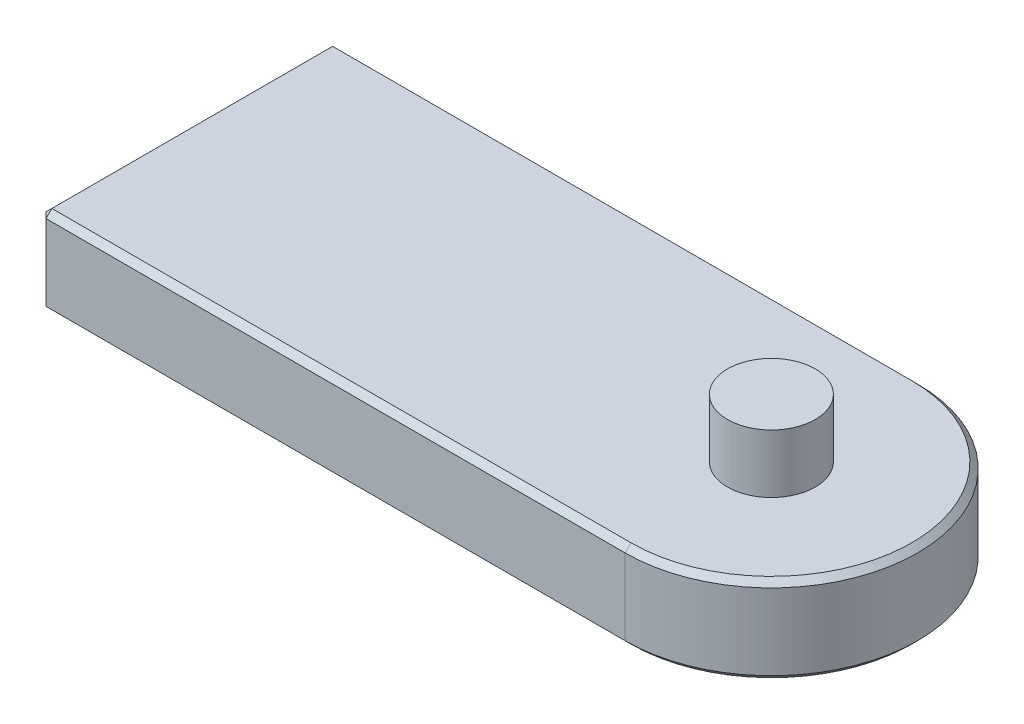
ISO-10303-21;
HEADER;
FILE_DESCRIPTION(('STEP AP214'),'2;1');
FILE_NAME('part.step','',(''),(''),'','','');
FILE_SCHEMA(('AUTOMOTIVE_DESIGN { 1 0 10303 214 1 1 1 1 }'));
ENDSEC;
DATA;
#1=APPLICATION_CONTEXT('core data for automotive mechanical design processes');
#2=APPLICATION_PROTOCOL_DEFINITION('international standard','automotive_design',2000,#1);
#3=PRODUCT_CONTEXT('',#1,'mechanical');
#4=PRODUCT('Part','Part','',(#3));
#5=PRODUCT_RELATED_PRODUCT_CATEGORY('part','',(#4));
#6=PRODUCT_DEFINITION_FORMATION('','',#4);
#7=PRODUCT_DEFINITION_CONTEXT('part definition',#1,'design');
#8=PRODUCT_DEFINITION('design','',#6,#7);
#9=PRODUCT_DEFINITION_SHAPE('','',#8);
#10=(LENGTH_UNIT() NAMED_UNIT(*) SI_UNIT(.MILLI.,.METRE.));
#11=(NAMED_UNIT(*) PLANE_ANGLE_UNIT() SI_UNIT($,.RADIAN.));
#12=(NAMED_UNIT(*) SI_UNIT($,.STERADIAN.) SOLID_ANGLE_UNIT());
#13=UNCERTAINTY_MEASURE_WITH_UNIT(LENGTH_MEASURE(1.E-05),#10,'distance_accuracy_value','');
#14=(GEOMETRIC_REPRESENTATION_CONTEXT(3) GLOBAL_UNCERTAINTY_ASSIGNED_CONTEXT((#13)) GLOBAL_UNIT_ASSIGNED_CONTEXT((#10,
#11,#12)) REPRESENTATION_CONTEXT('',''));
#15=CARTESIAN_POINT('',(0.,0.,0.));
#16=DIRECTION('',(0.,0.,1.));
#17=DIRECTION('',(1.,0.,0.));
#18=AXIS2_PLACEMENT_3D('',#15,#16,#17);
#19=CARTESIAN_POINT('',(100.,30.,0.));
#20=DIRECTION('',(0.,-1.,0.));
#21=DIRECTION('',(0.,0.,-1.));
#22=AXIS2_PLACEMENT_3D('',#19,#20,#21);
#23=CYLINDRICAL_SURFACE('',#22,50.);
#24=DIRECTION('',(0.,-1.,0.));
#25=VECTOR('',#24,1.);
#26=CARTESIAN_POINT('',(100.,30.,50.));
#27=LINE('',#26,#25);
#28=CARTESIAN_POINT('',(100.,28.,50.));
#29=VERTEX_POINT('',#28);
#30=CARTESIAN_POINT('',(100.,2.00000000000003,50.));
#31=VERTEX_POINT('',#30);
#32=EDGE_CURVE('E115',#29,#31,#27,.T.);
#33=ORIENTED_EDGE('',*,*,#32,.T.);
#34=CARTESIAN_POINT('',(100.,2.00000000000003,0.));
#35=DIRECTION('',(0.,1.,0.));
#36=DIRECTION('',(0.,0.,1.));
#37=AXIS2_PLACEMENT_3D('',#34,#35,#36);
#38=CIRCLE('',#37,50.);
#39=CARTESIAN_POINT('',(100.,2.00000000000003,-50.));
#40=VERTEX_POINT('',#39);
#41=EDGE_CURVE('E122',#31,#40,#38,.T.);
#42=ORIENTED_EDGE('',*,*,#41,.T.);
#43=DIRECTION('',(0.,-1.,0.));
#44=VECTOR('',#43,1.);
#45=CARTESIAN_POINT('',(100.,30.,-50.));
#46=LINE('',#45,#44);
#47=CARTESIAN_POINT('',(100.,28.,-50.));
#48=VERTEX_POINT('',#47);
#49=EDGE_CURVE('E117',#48,#40,#46,.T.);
#50=ORIENTED_EDGE('',*,*,#49,.F.);
#51=CARTESIAN_POINT('',(100.,28.,0.));
#52=DIRECTION('',(0.,1.,0.));
#53=DIRECTION('',(0.,0.,1.));
#54=AXIS2_PLACEMENT_3D('',#51,#52,#53);
#55=CIRCLE('',#54,50.);
#56=EDGE_CURVE('E113',#48,#29,#55,.F.);
#57=ORIENTED_EDGE('',*,*,#56,.T.);
#58=EDGE_LOOP('',(#33,#42,#50,#57));
#59=FACE_BOUND('',#58,.T.);
#60=ADVANCED_FACE('F35',(#59),#23,.T.);
#61=CARTESIAN_POINT('',(100.,30.,-50.));
#62=DIRECTION('',(0.,0.,1.));
#63=DIRECTION('',(1.,0.,0.));
#64=AXIS2_PLACEMENT_3D('',#61,#62,#63);
#65=PLANE('',#64);
#66=ORIENTED_EDGE('',*,*,#49,.T.);
#67=DIRECTION('',(-1.,0.,0.));
#68=VECTOR('',#67,1.);
#69=CARTESIAN_POINT('',(100.,2.00000000000003,-50.));
#70=LINE('',#69,#68);
#71=CARTESIAN_POINT('',(-98.,2.00000000000003,-50.));
#72=VERTEX_POINT('',#71);
#73=EDGE_CURVE('E123',#40,#72,#70,.T.);
#74=ORIENTED_EDGE('',*,*,#73,.T.);
#75=DIRECTION('',(0.,1.,0.));
#76=VECTOR('',#75,1.);
#77=CARTESIAN_POINT('',(-98.,30.,-50.));
#78=LINE('',#77,#76);
#79=CARTESIAN_POINT('',(-98.,28.,-50.));
#80=VERTEX_POINT('',#79);
#81=EDGE_CURVE('E163',#72,#80,#78,.T.);
#82=ORIENTED_EDGE('',*,*,#81,.T.);
#83=DIRECTION('',(1.,0.,0.));
#84=VECTOR('',#83,1.);
#85=CARTESIAN_POINT('',(100.,28.,-50.));
#86=LINE('',#85,#84);
#87=EDGE_CURVE('E161',#80,#48,#86,.T.);
#88=ORIENTED_EDGE('',*,*,#87,.T.);
#89=EDGE_LOOP('',(#66,#74,#82,#88));
#90=FACE_BOUND('',#89,.T.);
#91=ADVANCED_FACE('F242',(#90),#65,.F.);
#92=CARTESIAN_POINT('',(-100.,30.,-50.));
#93=DIRECTION('',(1.,0.,0.));
#94=DIRECTION('',(0.,0.,-1.));
#95=AXIS2_PLACEMENT_3D('',#92,#93,#94);
#96=PLANE('',#95);
#97=DIRECTION('',(0.,0.,-1.));
#98=VECTOR('',#97,1.);
#99=CARTESIAN_POINT('',(-100.,28.,-50.));
#100=LINE('',#99,#98);
#101=CARTESIAN_POINT('',(-100.,28.,48.));
#102=VERTEX_POINT('',#101);
#103=CARTESIAN_POINT('',(-100.,28.,-48.));
#104=VERTEX_POINT('',#103);
#105=EDGE_CURVE('E167',#102,#104,#100,.T.);
#106=ORIENTED_EDGE('',*,*,#105,.T.);
#107=DIRECTION('',(0.,-1.,0.));
#108=VECTOR('',#107,1.);
#109=CARTESIAN_POINT('',(-100.,30.,-48.));
#110=LINE('',#109,#108);
#111=CARTESIAN_POINT('',(-100.,2.,-48.));
#112=VERTEX_POINT('',#111);
#113=EDGE_CURVE('E173',#104,#112,#110,.T.);
#114=ORIENTED_EDGE('',*,*,#113,.T.);
#115=DIRECTION('',(0.,0.,1.));
#116=VECTOR('',#115,1.);
#117=CARTESIAN_POINT('',(-100.,2.,-50.));
#118=LINE('',#117,#116);
#119=CARTESIAN_POINT('',(-100.,2.,48.));
#120=VERTEX_POINT('',#119);
#121=EDGE_CURVE('E171',#112,#120,#118,.T.);
#122=ORIENTED_EDGE('',*,*,#121,.T.);
#123=DIRECTION('',(0.,1.,0.));
#124=VECTOR('',#123,1.);
#125=CARTESIAN_POINT('',(-100.,30.,48.));
#126=LINE('',#125,#124);
#127=EDGE_CURVE('E169',#120,#102,#126,.T.);
#128=ORIENTED_EDGE('',*,*,#127,.T.);
#129=EDGE_LOOP('',(#106,#114,#122,#128));
#130=FACE_BOUND('',#129,.T.);
#131=ADVANCED_FACE('F247',(#130),#96,.F.);
#132=CARTESIAN_POINT('',(-100.,30.,50.));
#133=DIRECTION('',(0.,0.,-1.));
#134=DIRECTION('',(-1.,0.,0.));
#135=AXIS2_PLACEMENT_3D('',#132,#133,#134);
#136=PLANE('',#135);
#137=DIRECTION('',(0.,-1.,0.));
#138=VECTOR('',#137,1.);
#139=CARTESIAN_POINT('',(-98.,30.,50.));
#140=LINE('',#139,#138);
#141=CARTESIAN_POINT('',(-98.,28.,50.));
#142=VERTEX_POINT('',#141);
#143=CARTESIAN_POINT('',(-98.,2.00000000000003,50.));
#144=VERTEX_POINT('',#143);
#145=EDGE_CURVE('E146',#142,#144,#140,.T.);
#146=ORIENTED_EDGE('',*,*,#145,.T.);
#147=DIRECTION('',(1.,0.,0.));
#148=VECTOR('',#147,1.);
#149=CARTESIAN_POINT('',(-100.,2.00000000000003,50.));
#150=LINE('',#149,#148);
#151=EDGE_CURVE('E132',#144,#31,#150,.T.);
#152=ORIENTED_EDGE('',*,*,#151,.T.);
#153=ORIENTED_EDGE('',*,*,#32,.F.);
#154=DIRECTION('',(-1.,0.,0.));
#155=VECTOR('',#154,1.);
#156=CARTESIAN_POINT('',(-100.,28.,50.));
#157=LINE('',#156,#155);
#158=EDGE_CURVE('E129',#29,#142,#157,.T.);
#159=ORIENTED_EDGE('',*,*,#158,.T.);
#160=EDGE_LOOP('',(#146,#152,#153,#159));
#161=FACE_BOUND('',#160,.T.);
#162=ADVANCED_FACE('F127',(#161),#136,.F.);
#163=CARTESIAN_POINT('',(100.,30.,0.));
#164=DIRECTION('',(0.,1.,0.));
#165=DIRECTION('',(0.,0.,1.));
#166=AXIS2_PLACEMENT_3D('',#163,#164,#165);
#167=PLANE('',#166);
#168=DIRECTION('',(-1.,0.,0.));
#169=VECTOR('',#168,1.);
#170=CARTESIAN_POINT('',(-100.,30.,-48.));
#171=LINE('',#170,#169);
#172=CARTESIAN_POINT('',(100.,30.,-48.));
#173=VERTEX_POINT('',#172);
#174=CARTESIAN_POINT('',(-98.,30.,-48.));
#175=VERTEX_POINT('',#174);
#176=EDGE_CURVE('E45',#173,#175,#171,.T.);
#177=ORIENTED_EDGE('',*,*,#176,.T.);
#178=DIRECTION('',(0.,0.,1.));
#179=VECTOR('',#178,1.);
#180=CARTESIAN_POINT('',(-98.,30.,50.));
#181=LINE('',#180,#179);
#182=CARTESIAN_POINT('',(-98.,30.,48.));
#183=VERTEX_POINT('',#182);
#184=EDGE_CURVE('E11',#175,#183,#181,.T.);
#185=ORIENTED_EDGE('',*,*,#184,.T.);
#186=DIRECTION('',(1.,0.,0.));
#187=VECTOR('',#186,1.);
#188=CARTESIAN_POINT('',(100.,30.,48.));
#189=LINE('',#188,#187);
#190=CARTESIAN_POINT('',(100.,30.,48.));
#191=VERTEX_POINT('',#190);
#192=EDGE_CURVE('E176',#183,#191,#189,.T.);
#193=ORIENTED_EDGE('',*,*,#192,.T.);
#194=CARTESIAN_POINT('',(100.,30.,0.));
#195=DIRECTION('',(0.,1.,0.));
#196=DIRECTION('',(0.,0.,1.));
#197=AXIS2_PLACEMENT_3D('',#194,#195,#196);
#198=CIRCLE('',#197,48.);
#199=EDGE_CURVE('E56',#191,#173,#198,.T.);
#200=ORIENTED_EDGE('',*,*,#199,.T.);
#201=EDGE_LOOP('',(#177,#185,#193,#200));
#202=FACE_BOUND('',#201,.T.);
#203=CARTESIAN_POINT('',(100.,30.,0.));
#204=DIRECTION('',(0.,1.,0.));
#205=DIRECTION('',(0.,0.,1.));
#206=AXIS2_PLACEMENT_3D('',#203,#204,#205);
#207=CIRCLE('',#206,15.);
#208=CARTESIAN_POINT('',(100.,30.,15.));
#209=VERTEX_POINT('',#208);
#210=EDGE_CURVE('E217',#209,#209,#207,.T.);
#211=ORIENTED_EDGE('',*,*,#210,.F.);
#212=EDGE_LOOP('',(#211));
#213=FACE_BOUND('',#212,.T.);
#214=ADVANCED_FACE('F237',(#202,#213),#167,.T.);
#215=CARTESIAN_POINT('',(100.,0.,0.));
#216=DIRECTION('',(0.,1.,0.));
#217=DIRECTION('',(0.,0.,1.));
#218=AXIS2_PLACEMENT_3D('',#215,#216,#217);
#219=PLANE('',#218);
#220=DIRECTION('',(1.,0.,0.));
#221=VECTOR('',#220,1.);
#222=CARTESIAN_POINT('',(100.,0.,-48.));
#223=LINE('',#222,#221);
#224=CARTESIAN_POINT('',(-98.,0.,-47.9999999999999));
#225=VERTEX_POINT('',#224);
#226=CARTESIAN_POINT('',(100.,0.,-48.));
#227=VERTEX_POINT('',#226);
#228=EDGE_CURVE('E154',#225,#227,#223,.T.);
#229=ORIENTED_EDGE('',*,*,#228,.T.);
#230=CARTESIAN_POINT('',(100.,0.,0.));
#231=DIRECTION('',(0.,1.,0.));
#232=DIRECTION('',(0.,0.,1.));
#233=AXIS2_PLACEMENT_3D('',#230,#231,#232);
#234=CIRCLE('',#233,48.);
#235=CARTESIAN_POINT('',(100.,0.,48.));
#236=VERTEX_POINT('',#235);
#237=EDGE_CURVE('E159',#227,#236,#234,.F.);
#238=ORIENTED_EDGE('',*,*,#237,.T.);
#239=DIRECTION('',(-1.,0.,0.));
#240=VECTOR('',#239,1.);
#241=CARTESIAN_POINT('',(100.,0.,48.));
#242=LINE('',#241,#240);
#243=CARTESIAN_POINT('',(-98.,0.,48.));
#244=VERTEX_POINT('',#243);
#245=EDGE_CURVE('E156',#236,#244,#242,.T.);
#246=ORIENTED_EDGE('',*,*,#245,.T.);
#247=DIRECTION('',(0.,0.,-1.));
#248=VECTOR('',#247,1.);
#249=CARTESIAN_POINT('',(-98.,0.,0.));
#250=LINE('',#249,#248);
#251=EDGE_CURVE('E152',#244,#225,#250,.T.);
#252=ORIENTED_EDGE('',*,*,#251,.T.);
#253=EDGE_LOOP('',(#229,#238,#246,#252));
#254=FACE_BOUND('',#253,.T.);
#255=ADVANCED_FACE('F230',(#254),#219,.F.);
#256=CARTESIAN_POINT('',(100.,50.,0.));
#257=DIRECTION('',(0.,-1.,0.));
#258=DIRECTION('',(0.,0.,-1.));
#259=AXIS2_PLACEMENT_3D('',#256,#257,#258);
#260=CYLINDRICAL_SURFACE('',#259,15.);
#261=CARTESIAN_POINT('',(100.,50.,0.));
#262=DIRECTION('',(0.,1.,0.));
#263=DIRECTION('',(0.,0.,1.));
#264=AXIS2_PLACEMENT_3D('',#261,#262,#263);
#265=CIRCLE('',#264,15.);
#266=CARTESIAN_POINT('',(100.,50.,15.));
#267=VERTEX_POINT('',#266);
#268=EDGE_CURVE('E133',#267,#267,#265,.T.);
#269=ORIENTED_EDGE('',*,*,#268,.F.);
#270=EDGE_LOOP('',(#269));
#271=FACE_BOUND('',#270,.T.);
#272=ORIENTED_EDGE('',*,*,#210,.T.);
#273=EDGE_LOOP('',(#272));
#274=FACE_BOUND('',#273,.T.);
#275=ADVANCED_FACE('F228',(#271,#274),#260,.T.);
#276=CARTESIAN_POINT('',(100.,50.,0.));
#277=DIRECTION('',(0.,1.,0.));
#278=DIRECTION('',(0.,0.,1.));
#279=AXIS2_PLACEMENT_3D('',#276,#277,#278);
#280=PLANE('',#279);
#281=ORIENTED_EDGE('',*,*,#268,.T.);
#282=EDGE_LOOP('',(#281));
#283=FACE_BOUND('',#282,.T.);
#284=ADVANCED_FACE('F226',(#283),#280,.T.);
#285=CARTESIAN_POINT('',(100.,30.,-48.));
#286=DIRECTION('',(0.,0.707106781186547,-0.707106781186547));
#287=DIRECTION('',(1.,0.,0.));
#288=AXIS2_PLACEMENT_3D('',#285,#286,#287);
#289=PLANE('',#288);
#290=DIRECTION('',(0.,-0.707106781186548,-0.707106781186548));
#291=VECTOR('',#290,1.);
#292=CARTESIAN_POINT('',(-98.,28.,-50.));
#293=LINE('',#292,#291);
#294=EDGE_CURVE('E212',#175,#80,#293,.T.);
#295=ORIENTED_EDGE('',*,*,#294,.F.);
#296=ORIENTED_EDGE('',*,*,#176,.F.);
#297=DIRECTION('',(0.,0.707106781186547,0.707106781186547));
#298=VECTOR('',#297,1.);
#299=CARTESIAN_POINT('',(100.,28.,-50.));
#300=LINE('',#299,#298);
#301=EDGE_CURVE('E40',#48,#173,#300,.T.);
#302=ORIENTED_EDGE('',*,*,#301,.F.);
#303=ORIENTED_EDGE('',*,*,#87,.F.);
#304=EDGE_LOOP('',(#295,#296,#302,#303));
#305=FACE_BOUND('',#304,.T.);
#306=ADVANCED_FACE('F38',(#305),#289,.T.);
#307=CARTESIAN_POINT('',(100.,30.,0.));
#308=DIRECTION('',(0.,-1.,0.));
#309=DIRECTION('',(0.,0.,-1.));
#310=AXIS2_PLACEMENT_3D('',#307,#308,#309);
#311=CONICAL_SURFACE('',#310,48.,0.785398163397448);
#312=ORIENTED_EDGE('',*,*,#301,.T.);
#313=ORIENTED_EDGE('',*,*,#199,.F.);
#314=DIRECTION('',(0.,0.707106781186547,-0.707106781186547));
#315=VECTOR('',#314,1.);
#316=CARTESIAN_POINT('',(100.,28.,50.));
#317=LINE('',#316,#315);
#318=EDGE_CURVE('E136',#29,#191,#317,.T.);
#319=ORIENTED_EDGE('',*,*,#318,.F.);
#320=ORIENTED_EDGE('',*,*,#56,.F.);
#321=EDGE_LOOP('',(#312,#313,#319,#320));
#322=FACE_BOUND('',#321,.T.);
#323=ADVANCED_FACE('F137',(#322),#311,.T.);
#324=CARTESIAN_POINT('',(-98.,28.,-50.));
#325=DIRECTION('',(-0.577350269189626,0.577350269189626,-0.577350269189626));
#326=DIRECTION('',(-0.707106781186547,0.,0.707106781186547));
#327=AXIS2_PLACEMENT_3D('',#324,#325,#326);
#328=PLANE('',#327);
#329=DIRECTION('',(0.707106781186547,0.,-0.707106781186547));
#330=VECTOR('',#329,1.);
#331=CARTESIAN_POINT('',(-98.,28.,-50.));
#332=LINE('',#331,#330);
#333=EDGE_CURVE('E141',#104,#80,#332,.T.);
#334=ORIENTED_EDGE('',*,*,#333,.F.);
#335=DIRECTION('',(0.707106781186547,0.707106781186547,0.));
#336=VECTOR('',#335,1.);
#337=CARTESIAN_POINT('',(-99.,29.,-48.));
#338=LINE('',#337,#336);
#339=EDGE_CURVE('E140',#175,#104,#338,.F.);
#340=ORIENTED_EDGE('',*,*,#339,.F.);
#341=ORIENTED_EDGE('',*,*,#294,.T.);
#342=EDGE_LOOP('',(#334,#340,#341));
#343=FACE_BOUND('',#342,.T.);
#344=ADVANCED_FACE('F327',(#343),#328,.T.);
#345=CARTESIAN_POINT('',(-98.,30.,0.));
#346=DIRECTION('',(-0.707106781186547,0.707106781186547,0.));
#347=DIRECTION('',(0.,0.,-1.));
#348=AXIS2_PLACEMENT_3D('',#345,#346,#347);
#349=PLANE('',#348);
#350=ORIENTED_EDGE('',*,*,#339,.T.);
#351=ORIENTED_EDGE('',*,*,#105,.F.);
#352=DIRECTION('',(-0.707106781186547,-0.707106781186547,0.));
#353=VECTOR('',#352,1.);
#354=CARTESIAN_POINT('',(-100.,28.,48.));
#355=LINE('',#354,#353);
#356=EDGE_CURVE('E206',#183,#102,#355,.T.);
#357=ORIENTED_EDGE('',*,*,#356,.F.);
#358=ORIENTED_EDGE('',*,*,#184,.F.);
#359=EDGE_LOOP('',(#350,#351,#357,#358));
#360=FACE_BOUND('',#359,.T.);
#361=ADVANCED_FACE('F321',(#360),#349,.T.);
#362=CARTESIAN_POINT('',(100.,30.,48.));
#363=DIRECTION('',(0.,0.707106781186547,0.707106781186547));
#364=DIRECTION('',(-1.,0.,0.));
#365=AXIS2_PLACEMENT_3D('',#362,#363,#364);
#366=PLANE('',#365);
#367=ORIENTED_EDGE('',*,*,#318,.T.);
#368=ORIENTED_EDGE('',*,*,#192,.F.);
#369=DIRECTION('',(0.,0.707106781186547,-0.707106781186547));
#370=VECTOR('',#369,1.);
#371=CARTESIAN_POINT('',(-98.,29.,49.));
#372=LINE('',#371,#370);
#373=EDGE_CURVE('E144',#142,#183,#372,.T.);
#374=ORIENTED_EDGE('',*,*,#373,.F.);
#375=ORIENTED_EDGE('',*,*,#158,.F.);
#376=EDGE_LOOP('',(#367,#368,#374,#375));
#377=FACE_BOUND('',#376,.T.);
#378=ADVANCED_FACE('F143',(#377),#366,.T.);
#379=CARTESIAN_POINT('',(-100.,30.,-48.));
#380=DIRECTION('',(0.707106781186547,0.,0.707106781186547));
#381=DIRECTION('',(0.,-1.,0.));
#382=AXIS2_PLACEMENT_3D('',#379,#380,#381);
#383=PLANE('',#382);
#384=ORIENTED_EDGE('',*,*,#333,.T.);
#385=ORIENTED_EDGE('',*,*,#81,.F.);
#386=DIRECTION('',(-0.707106781186548,0.,0.707106781186548));
#387=VECTOR('',#386,1.);
#388=CARTESIAN_POINT('',(-98.,2.00000000000003,-50.));
#389=LINE('',#388,#387);
#390=EDGE_CURVE('E202',#112,#72,#389,.F.);
#391=ORIENTED_EDGE('',*,*,#390,.F.);
#392=ORIENTED_EDGE('',*,*,#113,.F.);
#393=EDGE_LOOP('',(#384,#385,#391,#392));
#394=FACE_BOUND('',#393,.T.);
#395=ADVANCED_FACE('F308',(#394),#383,.F.);
#396=CARTESIAN_POINT('',(-100.,28.,48.));
#397=DIRECTION('',(-0.577350269189626,0.577350269189626,0.577350269189626));
#398=DIRECTION('',(0.707106781186547,0.,0.707106781186547));
#399=AXIS2_PLACEMENT_3D('',#396,#397,#398);
#400=PLANE('',#399);
#401=ORIENTED_EDGE('',*,*,#373,.T.);
#402=ORIENTED_EDGE('',*,*,#356,.T.);
#403=DIRECTION('',(-0.707106781186547,0.,-0.707106781186547));
#404=VECTOR('',#403,1.);
#405=CARTESIAN_POINT('',(-100.,28.,48.));
#406=LINE('',#405,#404);
#407=EDGE_CURVE('E196',#142,#102,#406,.T.);
#408=ORIENTED_EDGE('',*,*,#407,.F.);
#409=EDGE_LOOP('',(#401,#402,#408));
#410=FACE_BOUND('',#409,.T.);
#411=ADVANCED_FACE('F301',(#410),#400,.T.);
#412=CARTESIAN_POINT('',(-98.,2.00000000000003,-50.));
#413=DIRECTION('',(-0.57735026918962,-0.577350269189629,-0.577350269189629));
#414=DIRECTION('',(0.,0.707106781186547,-0.707106781186547));
#415=AXIS2_PLACEMENT_3D('',#412,#413,#414);
#416=PLANE('',#415);
#417=DIRECTION('',(0.,0.707106781186548,-0.707106781186548));
#418=VECTOR('',#417,1.);
#419=CARTESIAN_POINT('',(-98.,2.00000000000003,-50.));
#420=LINE('',#419,#418);
#421=EDGE_CURVE('E193',#225,#72,#420,.T.);
#422=ORIENTED_EDGE('',*,*,#421,.F.);
#423=DIRECTION('',(0.707106781186548,-0.707106781186548,0.));
#424=VECTOR('',#423,1.);
#425=CARTESIAN_POINT('',(-99.,1.00000000000003,-48.));
#426=LINE('',#425,#424);
#427=EDGE_CURVE('E199',#112,#225,#426,.T.);
#428=ORIENTED_EDGE('',*,*,#427,.F.);
#429=ORIENTED_EDGE('',*,*,#390,.T.);
#430=EDGE_LOOP('',(#422,#428,#429));
#431=FACE_BOUND('',#430,.T.);
#432=ADVANCED_FACE('F294',(#431),#416,.T.);
#433=CARTESIAN_POINT('',(-100.,2.,-50.));
#434=DIRECTION('',(0.707106781186547,0.707106781186547,0.));
#435=DIRECTION('',(0.,0.,1.));
#436=AXIS2_PLACEMENT_3D('',#433,#434,#435);
#437=PLANE('',#436);
#438=ORIENTED_EDGE('',*,*,#427,.T.);
#439=ORIENTED_EDGE('',*,*,#251,.F.);
#440=DIRECTION('',(-0.707106781186548,0.707106781186548,0.));
#441=VECTOR('',#440,1.);
#442=CARTESIAN_POINT('',(-98.,0.,48.));
#443=LINE('',#442,#441);
#444=EDGE_CURVE('E190',#120,#244,#443,.F.);
#445=ORIENTED_EDGE('',*,*,#444,.F.);
#446=ORIENTED_EDGE('',*,*,#121,.F.);
#447=EDGE_LOOP('',(#438,#439,#445,#446));
#448=FACE_BOUND('',#447,.T.);
#449=ADVANCED_FACE('F287',(#448),#437,.F.);
#450=CARTESIAN_POINT('',(-98.,30.,50.));
#451=DIRECTION('',(0.707106781186547,0.,-0.707106781186547));
#452=DIRECTION('',(0.,-1.,0.));
#453=AXIS2_PLACEMENT_3D('',#450,#451,#452);
#454=PLANE('',#453);
#455=ORIENTED_EDGE('',*,*,#407,.T.);
#456=ORIENTED_EDGE('',*,*,#127,.F.);
#457=DIRECTION('',(0.707106781186548,0.,0.707106781186548));
#458=VECTOR('',#457,1.);
#459=CARTESIAN_POINT('',(-99.,2.00000000000002,49.));
#460=LINE('',#459,#458);
#461=EDGE_CURVE('E187',#144,#120,#460,.F.);
#462=ORIENTED_EDGE('',*,*,#461,.F.);
#463=ORIENTED_EDGE('',*,*,#145,.F.);
#464=EDGE_LOOP('',(#455,#456,#462,#463));
#465=FACE_BOUND('',#464,.T.);
#466=ADVANCED_FACE('F280',(#465),#454,.F.);
#467=CARTESIAN_POINT('',(100.,2.00000000000003,-50.));
#468=DIRECTION('',(0.,0.707106781186547,0.707106781186547));
#469=DIRECTION('',(-1.,0.,0.));
#470=AXIS2_PLACEMENT_3D('',#467,#468,#469);
#471=PLANE('',#470);
#472=ORIENTED_EDGE('',*,*,#421,.T.);
#473=ORIENTED_EDGE('',*,*,#73,.F.);
#474=DIRECTION('',(0.,0.707106781186547,-0.707106781186547));
#475=VECTOR('',#474,1.);
#476=CARTESIAN_POINT('',(100.,0.,-48.));
#477=LINE('',#476,#475);
#478=EDGE_CURVE('E184',#227,#40,#477,.T.);
#479=ORIENTED_EDGE('',*,*,#478,.F.);
#480=ORIENTED_EDGE('',*,*,#228,.F.);
#481=EDGE_LOOP('',(#472,#473,#479,#480));
#482=FACE_BOUND('',#481,.T.);
#483=ADVANCED_FACE('F273',(#482),#471,.F.);
#484=CARTESIAN_POINT('',(-98.,0.,48.));
#485=DIRECTION('',(-0.57735026918962,-0.577350269189629,0.577350269189629));
#486=DIRECTION('',(0.,-0.707106781186547,-0.707106781186547));
#487=AXIS2_PLACEMENT_3D('',#484,#485,#486);
#488=PLANE('',#487);
#489=ORIENTED_EDGE('',*,*,#461,.T.);
#490=ORIENTED_EDGE('',*,*,#444,.T.);
#491=DIRECTION('',(0.,-0.707106781186547,-0.707106781186547));
#492=VECTOR('',#491,1.);
#493=CARTESIAN_POINT('',(-98.,0.,48.));
#494=LINE('',#493,#492);
#495=EDGE_CURVE('E182',#144,#244,#494,.T.);
#496=ORIENTED_EDGE('',*,*,#495,.F.);
#497=EDGE_LOOP('',(#489,#490,#496));
#498=FACE_BOUND('',#497,.T.);
#499=ADVANCED_FACE('F266',(#498),#488,.T.);
#500=CARTESIAN_POINT('',(100.,2.00000000000003,0.));
#501=DIRECTION('',(0.,1.,0.));
#502=DIRECTION('',(0.,0.,1.));
#503=AXIS2_PLACEMENT_3D('',#500,#501,#502);
#504=CONICAL_SURFACE('',#503,50.,0.785398163397448);
#505=ORIENTED_EDGE('',*,*,#478,.T.);
#506=ORIENTED_EDGE('',*,*,#41,.F.);
#507=DIRECTION('',(0.,0.707106781186547,0.707106781186547));
#508=VECTOR('',#507,1.);
#509=CARTESIAN_POINT('',(100.,0.,48.));
#510=LINE('',#509,#508);
#511=EDGE_CURVE('E180',#236,#31,#510,.T.);
#512=ORIENTED_EDGE('',*,*,#511,.F.);
#513=ORIENTED_EDGE('',*,*,#237,.F.);
#514=EDGE_LOOP('',(#505,#506,#512,#513));
#515=FACE_BOUND('',#514,.T.);
#516=ADVANCED_FACE('F259',(#515),#504,.T.);
#517=CARTESIAN_POINT('',(-100.,2.00000000000003,50.));
#518=DIRECTION('',(0.,0.707106781186547,-0.707106781186547));
#519=DIRECTION('',(1.,0.,0.));
#520=AXIS2_PLACEMENT_3D('',#517,#518,#519);
#521=PLANE('',#520);
#522=ORIENTED_EDGE('',*,*,#495,.T.);
#523=ORIENTED_EDGE('',*,*,#245,.F.);
#524=ORIENTED_EDGE('',*,*,#511,.T.);
#525=ORIENTED_EDGE('',*,*,#151,.F.);
#526=EDGE_LOOP('',(#522,#523,#524,#525));
#527=FACE_BOUND('',#526,.T.);
#528=ADVANCED_FACE('F253',(#527),#521,.F.);
#529=CLOSED_SHELL('',(#60,#91,#131,#162,#214,#255,#275,#284,#306,#323,#344,#361,#378,#395,#411,
#432,#449,#466,#483,#499,#516,#528));
#530=MANIFOLD_SOLID_BREP('B2',#529);
#531=ADVANCED_BREP_SHAPE_REPRESENTATION('',(#18,#530),#14);
#532=SHAPE_DEFINITION_REPRESENTATION(#9,#531);
ENDSEC;
END-ISO-10303-21;
